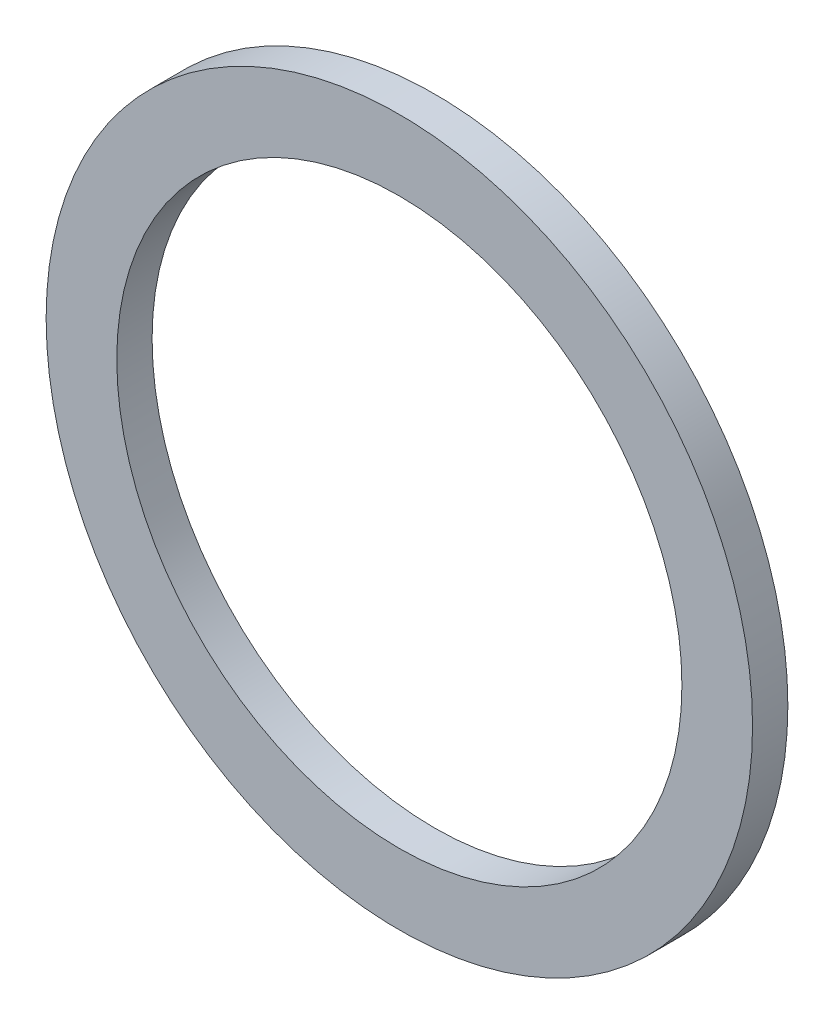
ISO-10303-21;
HEADER;
FILE_DESCRIPTION(('STEP AP214'),'2;1');
FILE_NAME('part.step','',(''),(''),'','','');
FILE_SCHEMA(('AUTOMOTIVE_DESIGN { 1 0 10303 214 1 1 1 1 }'));
ENDSEC;
DATA;
#1=APPLICATION_CONTEXT('core data for automotive mechanical design processes');
#2=APPLICATION_PROTOCOL_DEFINITION('international standard','automotive_design',2000,#1);
#3=PRODUCT_CONTEXT('',#1,'mechanical');
#4=PRODUCT('Part','Part','',(#3));
#5=PRODUCT_RELATED_PRODUCT_CATEGORY('part','',(#4));
#6=PRODUCT_DEFINITION_FORMATION('','',#4);
#7=PRODUCT_DEFINITION_CONTEXT('part definition',#1,'design');
#8=PRODUCT_DEFINITION('design','',#6,#7);
#9=PRODUCT_DEFINITION_SHAPE('','',#8);
#10=(LENGTH_UNIT() NAMED_UNIT(*) SI_UNIT(.MILLI.,.METRE.));
#11=(NAMED_UNIT(*) PLANE_ANGLE_UNIT() SI_UNIT($,.RADIAN.));
#12=(NAMED_UNIT(*) SI_UNIT($,.STERADIAN.) SOLID_ANGLE_UNIT());
#13=UNCERTAINTY_MEASURE_WITH_UNIT(LENGTH_MEASURE(1.E-05),#10,'distance_accuracy_value','');
#14=(GEOMETRIC_REPRESENTATION_CONTEXT(3) GLOBAL_UNCERTAINTY_ASSIGNED_CONTEXT((#13)) GLOBAL_UNIT_ASSIGNED_CONTEXT((#10,
#11,#12)) REPRESENTATION_CONTEXT('',''));
#15=CARTESIAN_POINT('',(0.,0.,0.));
#16=DIRECTION('',(0.,0.,1.));
#17=DIRECTION('',(1.,0.,0.));
#18=AXIS2_PLACEMENT_3D('',#15,#16,#17);
#19=CARTESIAN_POINT('',(-10.5000001639128,8.00000011920929,2.));
#20=DIRECTION('',(0.,0.,1.));
#21=DIRECTION('',(1.,0.,0.));
#22=AXIS2_PLACEMENT_3D('',#19,#20,#21);
#23=PLANE('',#22);
#24=CARTESIAN_POINT('',(-10.5000001639128,8.00000011920929,2.));
#25=DIRECTION('',(0.,0.,-1.));
#26=DIRECTION('',(-1.,0.,0.));
#27=AXIS2_PLACEMENT_3D('',#24,#25,#26);
#28=CIRCLE('',#27,0.8);
#29=CARTESIAN_POINT('',(-9.70000016391277,8.00000011920929,2.));
#30=VERTEX_POINT('',#29);
#31=EDGE_CURVE('E54',#30,#30,#28,.T.);
#32=ORIENTED_EDGE('',*,*,#31,.F.);
#33=EDGE_LOOP('',(#32));
#34=FACE_BOUND('',#33,.T.);
#35=CARTESIAN_POINT('',(-10.5000001639128,8.00000011920929,2.));
#36=DIRECTION('',(0.,0.,1.));
#37=DIRECTION('',(-1.,0.,0.));
#38=AXIS2_PLACEMENT_3D('',#35,#36,#37);
#39=CIRCLE('',#38,1.);
#40=CARTESIAN_POINT('',(-9.50000016391277,8.00000011920929,2.));
#41=VERTEX_POINT('',#40);
#42=EDGE_CURVE('E11',#41,#41,#39,.T.);
#43=ORIENTED_EDGE('',*,*,#42,.F.);
#44=EDGE_LOOP('',(#43));
#45=FACE_BOUND('',#44,.T.);
#46=ADVANCED_FACE('F17',(#34,#45),#23,.F.);
#47=CARTESIAN_POINT('',(-10.5000001639128,8.00000011920929,2.1));
#48=DIRECTION('',(0.,0.,1.));
#49=DIRECTION('',(1.,0.,0.));
#50=AXIS2_PLACEMENT_3D('',#47,#48,#49);
#51=PLANE('',#50);
#52=CARTESIAN_POINT('',(-10.5000001639128,8.00000011920929,2.1));
#53=DIRECTION('',(0.,0.,-1.));
#54=DIRECTION('',(-1.,0.,0.));
#55=AXIS2_PLACEMENT_3D('',#52,#53,#54);
#56=CIRCLE('',#55,0.8);
#57=CARTESIAN_POINT('',(-9.70000016391277,8.00000011920929,2.1));
#58=VERTEX_POINT('',#57);
#59=EDGE_CURVE('E52',#58,#58,#56,.T.);
#60=ORIENTED_EDGE('',*,*,#59,.T.);
#61=EDGE_LOOP('',(#60));
#62=FACE_BOUND('',#61,.T.);
#63=CARTESIAN_POINT('',(-10.5000001639128,8.00000011920929,2.1));
#64=DIRECTION('',(0.,0.,1.));
#65=DIRECTION('',(-1.,0.,0.));
#66=AXIS2_PLACEMENT_3D('',#63,#64,#65);
#67=CIRCLE('',#66,1.);
#68=CARTESIAN_POINT('',(-9.50000016391277,8.00000011920929,2.1));
#69=VERTEX_POINT('',#68);
#70=EDGE_CURVE('E66',#69,#69,#67,.T.);
#71=ORIENTED_EDGE('',*,*,#70,.T.);
#72=EDGE_LOOP('',(#71));
#73=FACE_BOUND('',#72,.T.);
#74=ADVANCED_FACE('F57',(#62,#73),#51,.T.);
#75=CARTESIAN_POINT('',(-10.5000001639128,8.00000011920929,2.));
#76=DIRECTION('',(0.,0.,1.));
#77=DIRECTION('',(-1.,0.,0.));
#78=AXIS2_PLACEMENT_3D('',#75,#76,#77);
#79=CYLINDRICAL_SURFACE('',#78,1.);
#80=ORIENTED_EDGE('',*,*,#70,.F.);
#81=DIRECTION('',(0.,0.,-1.));
#82=VECTOR('',#81,1.);
#83=CARTESIAN_POINT('',(-9.50000016391277,8.00000011920929,2.));
#84=LINE('',#83,#82);
#85=EDGE_CURVE('E28',#69,#41,#84,.T.);
#86=ORIENTED_EDGE('',*,*,#85,.T.);
#87=ORIENTED_EDGE('',*,*,#42,.T.);
#88=ORIENTED_EDGE('',*,*,#85,.F.);
#89=EDGE_LOOP('',(#80,#86,#87,#88));
#90=FACE_BOUND('',#89,.T.);
#91=ADVANCED_FACE('F76',(#90),#79,.T.);
#92=CARTESIAN_POINT('',(-10.5000001639128,8.00000011920929,2.));
#93=DIRECTION('',(0.,0.,1.));
#94=DIRECTION('',(-1.,0.,0.));
#95=AXIS2_PLACEMENT_3D('',#92,#93,#94);
#96=CYLINDRICAL_SURFACE('',#95,0.8);
#97=ORIENTED_EDGE('',*,*,#59,.F.);
#98=DIRECTION('',(0.,0.,-1.));
#99=VECTOR('',#98,1.);
#100=CARTESIAN_POINT('',(-9.70000016391277,8.00000011920929,2.));
#101=LINE('',#100,#99);
#102=EDGE_CURVE('E21',#58,#30,#101,.T.);
#103=ORIENTED_EDGE('',*,*,#102,.T.);
#104=ORIENTED_EDGE('',*,*,#31,.T.);
#105=ORIENTED_EDGE('',*,*,#102,.F.);
#106=EDGE_LOOP('',(#97,#103,#104,#105));
#107=FACE_BOUND('',#106,.T.);
#108=ADVANCED_FACE('F19',(#107),#96,.F.);
#109=CLOSED_SHELL('',(#46,#74,#91,#108));
#110=MANIFOLD_SOLID_BREP('B1',#109);
#111=ADVANCED_BREP_SHAPE_REPRESENTATION('',(#18,#110),#14);
#112=SHAPE_DEFINITION_REPRESENTATION(#9,#111);
ENDSEC;
END-ISO-10303-21;
